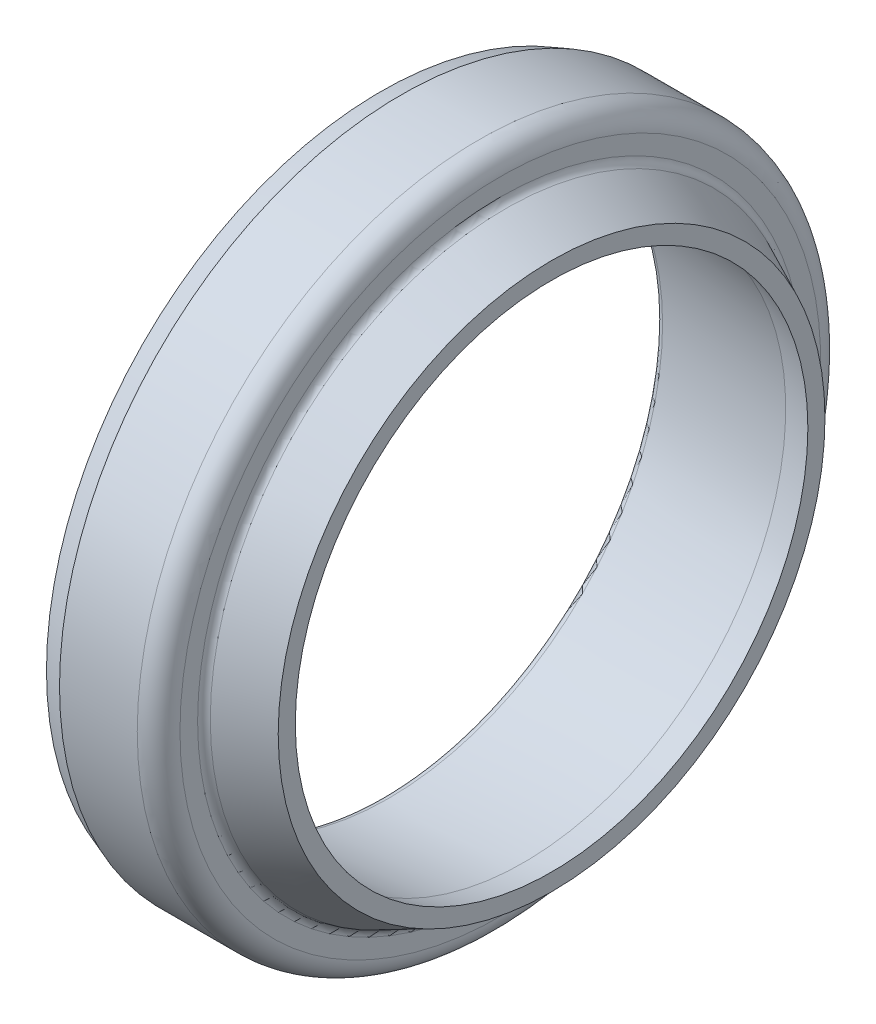
ISO-10303-21;
HEADER;
FILE_DESCRIPTION(('STEP AP214'),'2;1');
FILE_NAME('part.step','',(''),(''),'','','');
FILE_SCHEMA(('AUTOMOTIVE_DESIGN { 1 0 10303 214 1 1 1 1 }'));
ENDSEC;
DATA;
#1=APPLICATION_CONTEXT('core data for automotive mechanical design processes');
#2=APPLICATION_PROTOCOL_DEFINITION('international standard','automotive_design',2000,#1);
#3=PRODUCT_CONTEXT('',#1,'mechanical');
#4=PRODUCT('Part','Part','',(#3));
#5=PRODUCT_RELATED_PRODUCT_CATEGORY('part','',(#4));
#6=PRODUCT_DEFINITION_FORMATION('','',#4);
#7=PRODUCT_DEFINITION_CONTEXT('part definition',#1,'design');
#8=PRODUCT_DEFINITION('design','',#6,#7);
#9=PRODUCT_DEFINITION_SHAPE('','',#8);
#10=(LENGTH_UNIT() NAMED_UNIT(*) SI_UNIT(.MILLI.,.METRE.));
#11=(NAMED_UNIT(*) PLANE_ANGLE_UNIT() SI_UNIT($,.RADIAN.));
#12=(NAMED_UNIT(*) SI_UNIT($,.STERADIAN.) SOLID_ANGLE_UNIT());
#13=UNCERTAINTY_MEASURE_WITH_UNIT(LENGTH_MEASURE(1.E-05),#10,'distance_accuracy_value','');
#14=(GEOMETRIC_REPRESENTATION_CONTEXT(3) GLOBAL_UNCERTAINTY_ASSIGNED_CONTEXT((#13)) GLOBAL_UNIT_ASSIGNED_CONTEXT((#10,
#11,#12)) REPRESENTATION_CONTEXT('',''));
#15=CARTESIAN_POINT('',(0.,0.,0.));
#16=DIRECTION('',(0.,0.,1.));
#17=DIRECTION('',(1.,0.,0.));
#18=AXIS2_PLACEMENT_3D('',#15,#16,#17);
#19=CARTESIAN_POINT('',(578.261665053243,403.976990018396,0.));
#20=DIRECTION('',(1.,0.,0.));
#21=DIRECTION('',(0.,0.,-1.));
#22=AXIS2_PLACEMENT_3D('',#19,#20,#21);
#23=CONICAL_SURFACE('',#22,20.,0.349065850398542);
#24=CARTESIAN_POINT('',(577.061665053243,403.976990018396,0.));
#25=DIRECTION('',(-1.,0.,0.));
#26=DIRECTION('',(0.,0.,1.));
#27=AXIS2_PLACEMENT_3D('',#24,#25,#26);
#28=CIRCLE('',#27,19.563235718881);
#29=CARTESIAN_POINT('',(577.061665053243,403.976990018396,19.563235718881));
#30=VERTEX_POINT('',#29);
#31=EDGE_CURVE('E10',#30,#30,#28,.T.);
#32=ORIENTED_EDGE('',*,*,#31,.F.);
#33=EDGE_LOOP('',(#32));
#34=FACE_BOUND('',#33,.T.);
#35=CARTESIAN_POINT('',(578.261665053243,403.976990018396,0.));
#36=DIRECTION('',(-1.,0.,0.));
#37=DIRECTION('',(0.,0.,1.));
#38=AXIS2_PLACEMENT_3D('',#35,#36,#37);
#39=CIRCLE('',#38,20.);
#40=CARTESIAN_POINT('',(578.261665053243,403.976990018396,20.));
#41=VERTEX_POINT('',#40);
#42=EDGE_CURVE('E36',#41,#41,#39,.T.);
#43=ORIENTED_EDGE('',*,*,#42,.T.);
#44=EDGE_LOOP('',(#43));
#45=FACE_BOUND('',#44,.T.);
#46=ADVANCED_FACE('F30',(#34,#45),#23,.T.);
#47=CARTESIAN_POINT('',(577.061665053243,403.976990018396,0.));
#48=DIRECTION('',(-1.,0.,0.));
#49=DIRECTION('',(0.,0.,1.));
#50=AXIS2_PLACEMENT_3D('',#47,#48,#49);
#51=CYLINDRICAL_SURFACE('',#50,20.);
#52=ORIENTED_EDGE('',*,*,#42,.F.);
#53=EDGE_LOOP('',(#52));
#54=FACE_BOUND('',#53,.T.);
#55=CARTESIAN_POINT('',(582.811665053243,403.976990018396,0.));
#56=DIRECTION('',(-1.,0.,0.));
#57=DIRECTION('',(0.,0.,1.));
#58=AXIS2_PLACEMENT_3D('',#55,#56,#57);
#59=CIRCLE('',#58,20.);
#60=CARTESIAN_POINT('',(582.811665053243,403.976990018396,20.));
#61=VERTEX_POINT('',#60);
#62=EDGE_CURVE('E40',#61,#61,#59,.T.);
#63=ORIENTED_EDGE('',*,*,#62,.T.);
#64=EDGE_LOOP('',(#63));
#65=FACE_BOUND('',#64,.T.);
#66=ADVANCED_FACE('F83',(#54,#65),#51,.T.);
#67=CARTESIAN_POINT('',(582.811665053243,403.976990018396,0.));
#68=DIRECTION('',(-1.,0.,0.));
#69=DIRECTION('',(0.,0.,1.));
#70=AXIS2_PLACEMENT_3D('',#67,#68,#69);
#71=TOROIDAL_SURFACE('',#70,18.75,1.25000000000003);
#72=ORIENTED_EDGE('',*,*,#62,.F.);
#73=EDGE_LOOP('',(#72));
#74=FACE_BOUND('',#73,.T.);
#75=CARTESIAN_POINT('',(584.061665053243,403.976990018396,0.));
#76=DIRECTION('',(-1.,0.,0.));
#77=DIRECTION('',(0.,0.,1.));
#78=AXIS2_PLACEMENT_3D('',#75,#76,#77);
#79=CIRCLE('',#78,18.75);
#80=CARTESIAN_POINT('',(584.061665053243,403.976990018396,18.75));
#81=VERTEX_POINT('',#80);
#82=EDGE_CURVE('E44',#81,#81,#79,.T.);
#83=ORIENTED_EDGE('',*,*,#82,.T.);
#84=EDGE_LOOP('',(#83));
#85=FACE_BOUND('',#84,.T.);
#86=ADVANCED_FACE('F88',(#74,#85),#71,.T.);
#87=CARTESIAN_POINT('',(584.061665053243,422.726990018396,0.));
#88=DIRECTION('',(-1.,0.,0.));
#89=DIRECTION('',(0.,0.,1.));
#90=AXIS2_PLACEMENT_3D('',#87,#88,#89);
#91=PLANE('',#90);
#92=ORIENTED_EDGE('',*,*,#82,.F.);
#93=EDGE_LOOP('',(#92));
#94=FACE_BOUND('',#93,.T.);
#95=CARTESIAN_POINT('',(584.061665053243,403.976990018396,0.));
#96=DIRECTION('',(-1.,0.,0.));
#97=DIRECTION('',(0.,0.,1.));
#98=AXIS2_PLACEMENT_3D('',#95,#96,#97);
#99=CIRCLE('',#98,17.7174581048691);
#100=CARTESIAN_POINT('',(584.061665053243,403.976990018396,17.7174581048692));
#101=VERTEX_POINT('',#100);
#102=EDGE_CURVE('E49',#101,#101,#99,.T.);
#103=ORIENTED_EDGE('',*,*,#102,.T.);
#104=EDGE_LOOP('',(#103));
#105=FACE_BOUND('',#104,.T.);
#106=ADVANCED_FACE('F93',(#94,#105),#91,.F.);
#107=CARTESIAN_POINT('',(584.561665053242,403.976990018396,0.));
#108=DIRECTION('',(-1.,0.,0.));
#109=DIRECTION('',(0.,0.,1.));
#110=AXIS2_PLACEMENT_3D('',#107,#108,#109);
#111=TOROIDAL_SURFACE('',#110,17.7174581048691,0.499999999999829);
#112=ORIENTED_EDGE('',*,*,#102,.F.);
#113=EDGE_LOOP('',(#112));
#114=FACE_BOUND('',#113,.T.);
#115=CARTESIAN_POINT('',(584.350355922373,403.976990018396,0.));
#116=DIRECTION('',(-1.,0.,0.));
#117=DIRECTION('',(0.,0.,1.));
#118=AXIS2_PLACEMENT_3D('',#115,#116,#117);
#119=CIRCLE('',#118,17.2643042113504);
#120=CARTESIAN_POINT('',(584.350355922373,403.976990018396,17.2643042113505));
#121=VERTEX_POINT('',#120);
#122=EDGE_CURVE('E52',#121,#121,#119,.T.);
#123=ORIENTED_EDGE('',*,*,#122,.T.);
#124=EDGE_LOOP('',(#123));
#125=FACE_BOUND('',#124,.T.);
#126=ADVANCED_FACE('F100',(#114,#125),#111,.F.);
#127=CARTESIAN_POINT('',(587.061665053243,403.976990018396,0.));
#128=DIRECTION('',(-1.,0.,0.));
#129=DIRECTION('',(0.,0.,1.));
#130=AXIS2_PLACEMENT_3D('',#127,#128,#129);
#131=CONICAL_SURFACE('',#130,16.,0.436332312998695);
#132=ORIENTED_EDGE('',*,*,#122,.F.);
#133=EDGE_LOOP('',(#132));
#134=FACE_BOUND('',#133,.T.);
#135=CARTESIAN_POINT('',(587.061665053243,403.976990018396,0.));
#136=DIRECTION('',(-1.,0.,0.));
#137=DIRECTION('',(0.,0.,1.));
#138=AXIS2_PLACEMENT_3D('',#135,#136,#137);
#139=CIRCLE('',#138,16.);
#140=CARTESIAN_POINT('',(587.061665053243,403.976990018396,16.));
#141=VERTEX_POINT('',#140);
#142=EDGE_CURVE('E55',#141,#141,#139,.T.);
#143=ORIENTED_EDGE('',*,*,#142,.T.);
#144=EDGE_LOOP('',(#143));
#145=FACE_BOUND('',#144,.T.);
#146=ADVANCED_FACE('F104',(#134,#145),#131,.T.);
#147=CARTESIAN_POINT('',(587.061665053243,418.976990018396,0.));
#148=DIRECTION('',(-1.,0.,0.));
#149=DIRECTION('',(0.,0.,1.));
#150=AXIS2_PLACEMENT_3D('',#147,#148,#149);
#151=PLANE('',#150);
#152=ORIENTED_EDGE('',*,*,#142,.F.);
#153=EDGE_LOOP('',(#152));
#154=FACE_BOUND('',#153,.T.);
#155=CARTESIAN_POINT('',(587.061665053243,403.976990018396,0.));
#156=DIRECTION('',(-1.,0.,0.));
#157=DIRECTION('',(0.,0.,1.));
#158=AXIS2_PLACEMENT_3D('',#155,#156,#157);
#159=CIRCLE('',#158,15.);
#160=CARTESIAN_POINT('',(587.061665053243,403.976990018396,15.));
#161=VERTEX_POINT('',#160);
#162=EDGE_CURVE('E58',#161,#161,#159,.T.);
#163=ORIENTED_EDGE('',*,*,#162,.T.);
#164=EDGE_LOOP('',(#163));
#165=FACE_BOUND('',#164,.T.);
#166=ADVANCED_FACE('F108',(#154,#165),#151,.F.);
#167=CARTESIAN_POINT('',(585.415044514926,403.976990018396,0.));
#168=DIRECTION('',(-1.,0.,0.));
#169=DIRECTION('',(0.,0.,1.));
#170=AXIS2_PLACEMENT_3D('',#167,#168,#169);
#171=CONICAL_SURFACE('',#170,15.35,0.209439510239415);
#172=ORIENTED_EDGE('',*,*,#162,.F.);
#173=EDGE_LOOP('',(#172));
#174=FACE_BOUND('',#173,.T.);
#175=CARTESIAN_POINT('',(585.415044514926,403.976990018396,0.));
#176=DIRECTION('',(-1.,0.,0.));
#177=DIRECTION('',(0.,0.,1.));
#178=AXIS2_PLACEMENT_3D('',#175,#176,#177);
#179=CIRCLE('',#178,15.35);
#180=CARTESIAN_POINT('',(585.415044514926,403.976990018396,15.35));
#181=VERTEX_POINT('',#180);
#182=EDGE_CURVE('E61',#181,#181,#179,.T.);
#183=ORIENTED_EDGE('',*,*,#182,.T.);
#184=EDGE_LOOP('',(#183));
#185=FACE_BOUND('',#184,.T.);
#186=ADVANCED_FACE('F112',(#174,#185),#171,.F.);
#187=CARTESIAN_POINT('',(577.518087181869,403.976990018396,0.));
#188=DIRECTION('',(-1.,0.,0.));
#189=DIRECTION('',(0.,0.,1.));
#190=AXIS2_PLACEMENT_3D('',#187,#188,#189);
#191=CONICAL_SURFACE('',#190,16.0408942429903,0.0872664625997019);
#192=ORIENTED_EDGE('',*,*,#182,.F.);
#193=EDGE_LOOP('',(#192));
#194=FACE_BOUND('',#193,.T.);
#195=CARTESIAN_POINT('',(577.518087181869,403.976990018396,0.));
#196=DIRECTION('',(-1.,0.,0.));
#197=DIRECTION('',(0.,0.,1.));
#198=AXIS2_PLACEMENT_3D('',#195,#196,#197);
#199=CIRCLE('',#198,16.0408942429903);
#200=CARTESIAN_POINT('',(577.518087181869,403.976990018396,16.0408942429903));
#201=VERTEX_POINT('',#200);
#202=EDGE_CURVE('E64',#201,#201,#199,.T.);
#203=ORIENTED_EDGE('',*,*,#202,.T.);
#204=EDGE_LOOP('',(#203));
#205=FACE_BOUND('',#204,.T.);
#206=ADVANCED_FACE('F79',(#194,#205),#191,.F.);
#207=CARTESIAN_POINT('',(577.561665053243,403.976990018396,0.));
#208=DIRECTION('',(-1.,0.,0.));
#209=DIRECTION('',(0.,0.,1.));
#210=AXIS2_PLACEMENT_3D('',#207,#208,#209);
#211=TOROIDAL_SURFACE('',#210,16.5389915920361,0.49999999999995);
#212=ORIENTED_EDGE('',*,*,#202,.F.);
#213=EDGE_LOOP('',(#212));
#214=FACE_BOUND('',#213,.T.);
#215=CARTESIAN_POINT('',(577.061665053243,403.976990018396,0.));
#216=DIRECTION('',(-1.,0.,0.));
#217=DIRECTION('',(0.,0.,1.));
#218=AXIS2_PLACEMENT_3D('',#215,#216,#217);
#219=CIRCLE('',#218,16.5389915920361);
#220=CARTESIAN_POINT('',(577.061665053243,403.976990018396,16.5389915920361));
#221=VERTEX_POINT('',#220);
#222=EDGE_CURVE('E67',#221,#221,#219,.T.);
#223=ORIENTED_EDGE('',*,*,#222,.T.);
#224=EDGE_LOOP('',(#223));
#225=FACE_BOUND('',#224,.T.);
#226=ADVANCED_FACE('F71',(#214,#225),#211,.T.);
#227=CARTESIAN_POINT('',(577.061665053243,423.226990018396,0.));
#228=DIRECTION('',(1.,0.,0.));
#229=DIRECTION('',(0.,0.,-1.));
#230=AXIS2_PLACEMENT_3D('',#227,#228,#229);
#231=PLANE('',#230);
#232=ORIENTED_EDGE('',*,*,#222,.F.);
#233=EDGE_LOOP('',(#232));
#234=FACE_BOUND('',#233,.T.);
#235=ORIENTED_EDGE('',*,*,#31,.T.);
#236=EDGE_LOOP('',(#235));
#237=FACE_BOUND('',#236,.T.);
#238=ADVANCED_FACE('F73',(#234,#237),#231,.F.);
#239=CLOSED_SHELL('',(#46,#66,#86,#106,#126,#146,#166,#186,#206,#226,#238));
#240=MANIFOLD_SOLID_BREP('B2',#239);
#241=ADVANCED_BREP_SHAPE_REPRESENTATION('',(#18,#240),#14);
#242=SHAPE_DEFINITION_REPRESENTATION(#9,#241);
ENDSEC;
END-ISO-10303-21;
